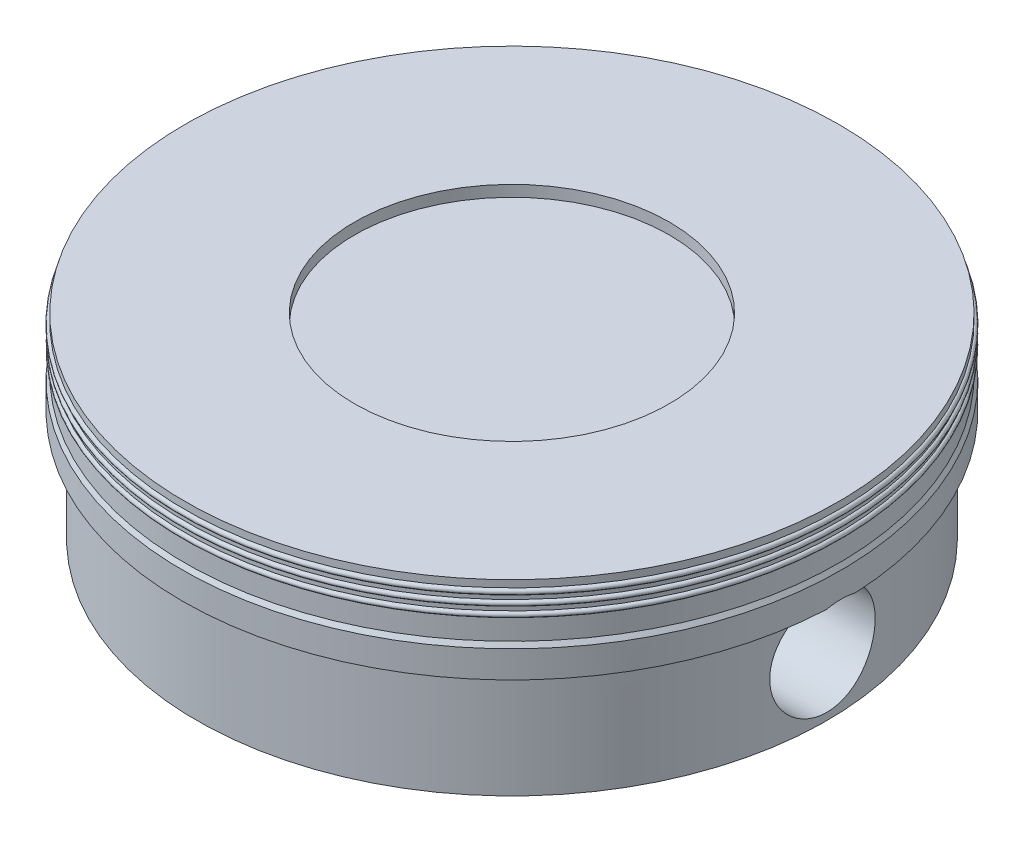
ISO-10303-21;
HEADER;
FILE_DESCRIPTION(('STEP AP214'),'2;1');
FILE_NAME('part.step','',(''),(''),'','','');
FILE_SCHEMA(('AUTOMOTIVE_DESIGN { 1 0 10303 214 1 1 1 1 }'));
ENDSEC;
DATA;
#1=APPLICATION_CONTEXT('core data for automotive mechanical design processes');
#2=APPLICATION_PROTOCOL_DEFINITION('international standard','automotive_design',2000,#1);
#3=PRODUCT_CONTEXT('',#1,'mechanical');
#4=PRODUCT('Part','Part','',(#3));
#5=PRODUCT_RELATED_PRODUCT_CATEGORY('part','',(#4));
#6=PRODUCT_DEFINITION_FORMATION('','',#4);
#7=PRODUCT_DEFINITION_CONTEXT('part definition',#1,'design');
#8=PRODUCT_DEFINITION('design','',#6,#7);
#9=PRODUCT_DEFINITION_SHAPE('','',#8);
#10=(LENGTH_UNIT() NAMED_UNIT(*) SI_UNIT(.MILLI.,.METRE.));
#11=(NAMED_UNIT(*) PLANE_ANGLE_UNIT() SI_UNIT($,.RADIAN.));
#12=(NAMED_UNIT(*) SI_UNIT($,.STERADIAN.) SOLID_ANGLE_UNIT());
#13=UNCERTAINTY_MEASURE_WITH_UNIT(LENGTH_MEASURE(1.E-05),#10,'distance_accuracy_value','');
#14=(GEOMETRIC_REPRESENTATION_CONTEXT(3) GLOBAL_UNCERTAINTY_ASSIGNED_CONTEXT((#13)) GLOBAL_UNIT_ASSIGNED_CONTEXT((#10,
#11,#12)) REPRESENTATION_CONTEXT('',''));
#15=CARTESIAN_POINT('',(0.,0.,0.));
#16=DIRECTION('',(0.,0.,1.));
#17=DIRECTION('',(1.,0.,0.));
#18=AXIS2_PLACEMENT_3D('',#15,#16,#17);
#19=CARTESIAN_POINT('',(5.,1.68,0.));
#20=DIRECTION('',(0.,-1.,0.));
#21=DIRECTION('',(0.,0.,-1.));
#22=AXIS2_PLACEMENT_3D('',#19,#20,#21);
#23=PLANE('',#22);
#24=DIRECTION('',(1.,0.,0.));
#25=VECTOR('',#24,1.);
#26=CARTESIAN_POINT('',(-5.00231465504995,1.68,-0.217025344142107));
#27=LINE('',#26,#25);
#28=CARTESIAN_POINT('',(-4.99528777949779,1.68,-0.217025344142107));
#29=VERTEX_POINT('',#28);
#30=CARTESIAN_POINT('',(-4.77507068010517,1.68,-0.217025344142107));
#31=VERTEX_POINT('',#30);
#32=EDGE_CURVE('E115',#29,#31,#27,.T.);
#33=ORIENTED_EDGE('',*,*,#32,.F.);
#34=CARTESIAN_POINT('',(0.,1.68,0.));
#35=DIRECTION('',(0.,-1.,0.));
#36=DIRECTION('',(0.,0.,-1.));
#37=AXIS2_PLACEMENT_3D('',#34,#35,#36);
#38=CIRCLE('',#37,5.);
#39=CARTESIAN_POINT('',(4.99528777949779,1.68,-0.217025344142107));
#40=VERTEX_POINT('',#39);
#41=EDGE_CURVE('E126',#29,#40,#38,.T.);
#42=ORIENTED_EDGE('',*,*,#41,.T.);
#43=CARTESIAN_POINT('',(4.77507068010517,1.68,-0.217025344142107));
#44=VERTEX_POINT('',#43);
#45=EDGE_CURVE('E60',#44,#40,#27,.T.);
#46=ORIENTED_EDGE('',*,*,#45,.F.);
#47=CARTESIAN_POINT('',(0.,1.68,0.));
#48=DIRECTION('',(0.,-1.,0.));
#49=DIRECTION('',(0.,0.,-1.));
#50=AXIS2_PLACEMENT_3D('',#47,#48,#49);
#51=CIRCLE('',#50,4.78);
#52=EDGE_CURVE('E45',#31,#44,#51,.T.);
#53=ORIENTED_EDGE('',*,*,#52,.F.);
#54=EDGE_LOOP('',(#33,#42,#46,#53));
#55=FACE_BOUND('',#54,.T.);
#56=ADVANCED_FACE('F35',(#55),#23,.T.);
#57=CARTESIAN_POINT('',(4.2,2.33,0.));
#58=DIRECTION('',(0.,-1.,0.));
#59=DIRECTION('',(0.,0.,-1.));
#60=AXIS2_PLACEMENT_3D('',#57,#58,#59);
#61=PLANE('',#60);
#62=CARTESIAN_POINT('',(0.,2.33,0.));
#63=DIRECTION('',(0.,-1.,0.));
#64=DIRECTION('',(0.,0.,-1.));
#65=AXIS2_PLACEMENT_3D('',#62,#63,#64);
#66=CIRCLE('',#65,4.2);
#67=CARTESIAN_POINT('',(0.,2.33,-4.2));
#68=VERTEX_POINT('',#67);
#69=EDGE_CURVE('E223',#68,#68,#66,.T.);
#70=ORIENTED_EDGE('',*,*,#69,.T.);
#71=EDGE_LOOP('',(#70));
#72=FACE_BOUND('',#71,.T.);
#73=DIRECTION('',(0.,0.,1.));
#74=VECTOR('',#73,1.);
#75=CARTESIAN_POINT('',(-1.5,2.33,3.08462315364454));
#76=LINE('',#75,#74);
#77=CARTESIAN_POINT('',(-1.5,2.33,-3.08462315364454));
#78=VERTEX_POINT('',#77);
#79=CARTESIAN_POINT('',(-1.5,2.33,3.08462315364454));
#80=VERTEX_POINT('',#79);
#81=EDGE_CURVE('E194',#78,#80,#76,.T.);
#82=ORIENTED_EDGE('',*,*,#81,.F.);
#83=CARTESIAN_POINT('',(0.,2.33,0.));
#84=DIRECTION('',(0.,-1.,0.));
#85=DIRECTION('',(0.,0.,-1.));
#86=AXIS2_PLACEMENT_3D('',#83,#84,#85);
#87=CIRCLE('',#86,3.43);
#88=EDGE_CURVE('E199',#80,#78,#87,.T.);
#89=ORIENTED_EDGE('',*,*,#88,.F.);
#90=EDGE_LOOP('',(#82,#89));
#91=FACE_BOUND('',#90,.T.);
#92=DIRECTION('',(0.,0.,-1.));
#93=VECTOR('',#92,1.);
#94=CARTESIAN_POINT('',(1.5,2.33,3.08462315364454));
#95=LINE('',#94,#93);
#96=CARTESIAN_POINT('',(1.5,2.33,3.08462315364454));
#97=VERTEX_POINT('',#96);
#98=CARTESIAN_POINT('',(1.5,2.33,-3.08462315364454));
#99=VERTEX_POINT('',#98);
#100=EDGE_CURVE('E176',#97,#99,#95,.T.);
#101=ORIENTED_EDGE('',*,*,#100,.F.);
#102=CARTESIAN_POINT('',(0.,2.33,0.));
#103=DIRECTION('',(0.,-1.,0.));
#104=DIRECTION('',(0.,0.,-1.));
#105=AXIS2_PLACEMENT_3D('',#102,#103,#104);
#106=CIRCLE('',#105,3.43);
#107=EDGE_CURVE('E181',#99,#97,#106,.T.);
#108=ORIENTED_EDGE('',*,*,#107,.F.);
#109=EDGE_LOOP('',(#101,#108));
#110=FACE_BOUND('',#109,.T.);
#111=ADVANCED_FACE('F272',(#72,#91,#110),#61,.T.);
#112=CARTESIAN_POINT('',(0.,0.,0.));
#113=DIRECTION('',(0.,-1.,0.));
#114=DIRECTION('',(0.,0.,-1.));
#115=AXIS2_PLACEMENT_3D('',#112,#113,#114);
#116=CYLINDRICAL_SURFACE('',#115,3.43);
#117=CARTESIAN_POINT('',(0.,1.93,0.));
#118=DIRECTION('',(0.,-1.,0.));
#119=DIRECTION('',(0.,0.,-1.));
#120=AXIS2_PLACEMENT_3D('',#117,#118,#119);
#121=CIRCLE('',#120,3.43);
#122=CARTESIAN_POINT('',(1.5,1.93,3.08462315364454));
#123=VERTEX_POINT('',#122);
#124=CARTESIAN_POINT('',(-1.5,1.93,3.08462315364454));
#125=VERTEX_POINT('',#124);
#126=EDGE_CURVE('E215',#123,#125,#121,.T.);
#127=ORIENTED_EDGE('',*,*,#126,.F.);
#128=DIRECTION('',(0.,1.,0.));
#129=VECTOR('',#128,1.);
#130=CARTESIAN_POINT('',(1.5,-6.46409313051723,3.08462315364454));
#131=LINE('',#130,#129);
#132=CARTESIAN_POINT('',(1.5,0.,3.08462315364454));
#133=VERTEX_POINT('',#132);
#134=EDGE_CURVE('E180',#133,#123,#131,.T.);
#135=ORIENTED_EDGE('',*,*,#134,.F.);
#136=CARTESIAN_POINT('',(0.,0.,0.));
#137=DIRECTION('',(0.,-1.,0.));
#138=DIRECTION('',(0.,0.,-1.));
#139=AXIS2_PLACEMENT_3D('',#136,#137,#138);
#140=CIRCLE('',#139,3.43);
#141=CARTESIAN_POINT('',(-1.5,0.,3.08462315364454));
#142=VERTEX_POINT('',#141);
#143=EDGE_CURVE('E212',#133,#142,#140,.T.);
#144=ORIENTED_EDGE('',*,*,#143,.T.);
#145=DIRECTION('',(0.,1.,0.));
#146=VECTOR('',#145,1.);
#147=CARTESIAN_POINT('',(-1.5,-6.46409313051723,3.08462315364454));
#148=LINE('',#147,#146);
#149=EDGE_CURVE('E202',#142,#125,#148,.T.);
#150=ORIENTED_EDGE('',*,*,#149,.T.);
#151=EDGE_LOOP('',(#127,#135,#144,#150));
#152=FACE_BOUND('',#151,.T.);
#153=ADVANCED_FACE('F277',(#152),#116,.F.);
#154=CARTESIAN_POINT('',(-1.5,0.,-3.08462315364454));
#155=VERTEX_POINT('',#154);
#156=CARTESIAN_POINT('',(1.5,0.,-3.08462315364454));
#157=VERTEX_POINT('',#156);
#158=EDGE_CURVE('E213',#155,#157,#140,.T.);
#159=ORIENTED_EDGE('',*,*,#158,.T.);
#160=DIRECTION('',(0.,1.,0.));
#161=VECTOR('',#160,1.);
#162=CARTESIAN_POINT('',(1.5,-6.46409313051723,-3.08462315364454));
#163=LINE('',#162,#161);
#164=CARTESIAN_POINT('',(1.5,1.93,-3.08462315364454));
#165=VERTEX_POINT('',#164);
#166=EDGE_CURVE('E184',#157,#165,#163,.T.);
#167=ORIENTED_EDGE('',*,*,#166,.T.);
#168=CARTESIAN_POINT('',(-1.5,1.93,-3.08462315364454));
#169=VERTEX_POINT('',#168);
#170=EDGE_CURVE('E220',#169,#165,#121,.T.);
#171=ORIENTED_EDGE('',*,*,#170,.F.);
#172=DIRECTION('',(0.,1.,0.));
#173=VECTOR('',#172,1.);
#174=CARTESIAN_POINT('',(-1.5,-6.46409313051723,-3.08462315364454));
#175=LINE('',#174,#173);
#176=EDGE_CURVE('E198',#155,#169,#175,.T.);
#177=ORIENTED_EDGE('',*,*,#176,.F.);
#178=EDGE_LOOP('',(#159,#167,#171,#177));
#179=FACE_BOUND('',#178,.T.);
#180=ADVANCED_FACE('F286',(#179),#116,.F.);
#181=CARTESIAN_POINT('',(0.,0.,0.));
#182=DIRECTION('',(0.,-1.,0.));
#183=DIRECTION('',(0.,0.,-1.));
#184=AXIS2_PLACEMENT_3D('',#181,#182,#183);
#185=CYLINDRICAL_SURFACE('',#184,4.78);
#186=CARTESIAN_POINT('',(-4.77507068010517,1.68,-0.217025344142108));
#187=CARTESIAN_POINT('',(-4.77311674454234,1.66781545501285,-0.260389997840914));
#188=CARTESIAN_POINT('',(-4.77058685151336,1.65191421075662,-0.302658617409448));
#189=CARTESIAN_POINT('',(-4.76473120839085,1.61331601743286,-0.383861318073952));
#190=CARTESIAN_POINT('',(-4.76140626252574,1.59062592976735,-0.422798715140795));
#191=CARTESIAN_POINT('',(-4.75431061348991,1.53905634512323,-0.496294501252224));
#192=CARTESIAN_POINT('',(-4.75053983511395,1.51017580323822,-0.530852149456165));
#193=CARTESIAN_POINT('',(-4.7429770373271,1.44704123469794,-0.594642145847164));
#194=CARTESIAN_POINT('',(-4.7391850190532,1.41278749307178,-0.623874776329791));
#195=CARTESIAN_POINT('',(-4.73198231554192,1.33963445348543,-0.676351887298078));
#196=CARTESIAN_POINT('',(-4.72857386348334,1.30071042802205,-0.699562233458879));
#197=CARTESIAN_POINT('',(-4.722554449733,1.21945126202537,-0.73910854464259));
#198=CARTESIAN_POINT('',(-4.7199435335669,1.17711592693891,-0.755444117253648));
#199=CARTESIAN_POINT('',(-4.71583989573606,1.09055475865284,-0.780651928805573));
#200=CARTESIAN_POINT('',(-4.71433931182688,1.04634460825845,-0.789576699682988));
#201=CARTESIAN_POINT('',(-4.71260225277348,0.957032751672788,-0.799880045235941));
#202=CARTESIAN_POINT('',(-4.71236561191707,0.911931163133861,-0.801259609143973));
#203=CARTESIAN_POINT('',(-4.71317900815314,0.822677727153014,-0.796460213173481));
#204=CARTESIAN_POINT('',(-4.71421397175652,0.778520946037443,-0.790369803192592));
#205=CARTESIAN_POINT('',(-4.7174257766452,0.691867355104174,-0.770966694821859));
#206=CARTESIAN_POINT('',(-4.71960265705315,0.649370602213479,-0.757653748983772));
#207=CARTESIAN_POINT('',(-4.72485660636636,0.56713060397223,-0.724165813365828));
#208=CARTESIAN_POINT('',(-4.72793556010964,0.527393341700135,-0.703976441127867));
#209=CARTESIAN_POINT('',(-4.73464750015667,0.451846186290576,-0.657317733090283));
#210=CARTESIAN_POINT('',(-4.7382805289058,0.416036594397233,-0.630847916085479));
#211=CARTESIAN_POINT('',(-4.74574814670546,0.348880399682881,-0.571982147608413));
#212=CARTESIAN_POINT('',(-4.74958470463595,0.317596008918016,-0.539515441920733));
#213=CARTESIAN_POINT('',(-4.75698830468753,0.26090071643192,-0.469776200289964));
#214=CARTESIAN_POINT('',(-4.76055533948057,0.23548997437027,-0.43250353375245));
#215=CARTESIAN_POINT('',(-4.76703400126186,0.1911835506644,-0.354034042364042));
#216=CARTESIAN_POINT('',(-4.76994321603747,0.172311716637691,-0.312823538628382));
#217=CARTESIAN_POINT('',(-4.77476061322142,0.141776205047494,-0.227758381569901));
#218=CARTESIAN_POINT('',(-4.77666887341471,0.13011196736357,-0.183903934005386));
#219=CARTESIAN_POINT('',(-4.77925311923535,0.114437264129416,-0.0953004936420972));
#220=CARTESIAN_POINT('',(-4.77994216086845,0.110345684668121,-0.0505662307842665));
#221=CARTESIAN_POINT('',(-4.78005079027309,0.10969643280476,0.0389570033491304));
#222=CARTESIAN_POINT('',(-4.7794704468681,0.113138351951783,0.0837459715270976));
#223=CARTESIAN_POINT('',(-4.77711565664269,0.127387693539074,0.171718625850184));
#224=CARTESIAN_POINT('',(-4.77535116971636,0.138133690579977,0.214912556661851));
#225=CARTESIAN_POINT('',(-4.77083222456877,0.16660481485125,0.298879816869771));
#226=CARTESIAN_POINT('',(-4.76807772295137,0.184330248020286,0.33965304006584));
#227=CARTESIAN_POINT('',(-4.76185735284646,0.226392438799284,0.417933619716713));
#228=CARTESIAN_POINT('',(-4.75838675692455,0.25077349929401,0.455416783633629));
#229=CARTESIAN_POINT('',(-4.75112593986705,0.305410165362693,0.525790773700132));
#230=CARTESIAN_POINT('',(-4.74733569379902,0.335666229422007,0.558681241091011));
#231=CARTESIAN_POINT('',(-4.73980727708292,0.401614121406434,0.619333370466703));
#232=CARTESIAN_POINT('',(-4.73607022605573,0.437365119679956,0.64703088003082));
#233=CARTESIAN_POINT('',(-4.72911708259974,0.513054069657323,0.696036212012279));
#234=CARTESIAN_POINT('',(-4.72590098778355,0.552992002172202,0.717344063712075));
#235=CARTESIAN_POINT('',(-4.72036394830086,0.635881027755402,0.752920794222775));
#236=CARTESIAN_POINT('',(-4.71804171930698,0.678827692065178,0.767199780566341));
#237=CARTESIAN_POINT('',(-4.71455803308112,0.766555057162941,0.788326469780904));
#238=CARTESIAN_POINT('',(-4.71339644749025,0.811335554571722,0.795174994415193));
#239=CARTESIAN_POINT('',(-4.71237792548226,0.900855119314812,0.801188832970666));
#240=CARTESIAN_POINT('',(-4.712504716309,0.945587583461906,0.800449977549886));
#241=CARTESIAN_POINT('',(-4.7140089366155,1.03428625093362,0.791542596891841));
#242=CARTESIAN_POINT('',(-4.71538641020499,1.07825242717667,0.783373809611892));
#243=CARTESIAN_POINT('',(-4.71922515448502,1.16399796218298,0.759903429890645));
#244=CARTESIAN_POINT('',(-4.72168213100792,1.2057852589046,0.744630084761228));
#245=CARTESIAN_POINT('',(-4.72740111237165,1.28620740457162,0.707411877504114));
#246=CARTESIAN_POINT('',(-4.73066306052802,1.32484247523554,0.685467485112687));
#247=CARTESIAN_POINT('',(-4.73766913754596,1.39832684053879,0.635246489063792));
#248=CARTESIAN_POINT('',(-4.74141811176241,1.43313053715318,0.606903797016646));
#249=CARTESIAN_POINT('',(-4.7489532451895,1.4975217381228,0.544812975714157));
#250=CARTESIAN_POINT('',(-4.75273941333657,1.5271079548491,0.511063516026313));
#251=CARTESIAN_POINT('',(-4.76019658054344,1.58221567707855,0.436382904178649));
#252=CARTESIAN_POINT('',(-4.76383860975078,1.60727795424229,0.395106051997313));
#253=CARTESIAN_POINT('',(-4.76862414691184,1.63903057077708,0.330299567261004));
#254=CARTESIAN_POINT('',(-4.77010793138987,1.6486502148414,0.308184135262336));
#255=CARTESIAN_POINT('',(-4.77280388719458,1.6658617378349,0.263159914490986));
#256=CARTESIAN_POINT('',(-4.77401603731461,1.67345345845173,0.240251063936713));
#257=CARTESIAN_POINT('',(-4.77507068010517,1.68,0.217025344142108));
#258=B_SPLINE_CURVE_WITH_KNOTS('',3,(#186,#187,#188,#189,#190,#191,#192,#193,#194,#195,#196,
#197,#198,#199,#200,#201,#202,#203,#204,#205,#206,#207,#208,#209,#210,#211,#212,#213,#214,#215,
#216,#217,#218,#219,#220,#221,#222,#223,#224,#225,#226,#227,#228,#229,#230,#231,#232,#233,#234,
#235,#236,#237,#238,#239,#240,#241,#242,#243,#244,#245,#246,#247,#248,#249,#250,#251,#252,#253,
#254,#255,#256,#257),.UNSPECIFIED.,.F.,.F.,(4,2,2,2,2,2,2,2,2,2,2,2,2,2,2,2,2,2,2,2,2,2,2,2,2,2,
2,2,2,2,2,2,2,2,2,4),(0.,0.135061280341502,0.269986514358779,0.404934540793564,
0.539875411135068,0.675565195916631,0.81126272481659,0.945989937250957,1.08069948552684,
1.21382749053972,1.34696005688289,1.48037280557488,1.61379577960147,1.74890717311241,
1.88402223883692,2.01962501133353,2.15521724447197,2.28934849434868,2.42347247208309,
2.556482234058,2.6894978270713,2.82342138218052,2.95735539288927,3.09284832298829,
3.22834063214234,3.36363752953,3.49891946238859,3.63249487099912,3.76607499079898,
3.89912848475602,4.03217261203068,4.16665952396069,4.30117957979026,4.4455970880261,
4.5179990352962,4.59040663306323),.UNSPECIFIED.);
#259=CARTESIAN_POINT('',(-4.77507068010517,1.68,0.217025344142107));
#260=VERTEX_POINT('',#259);
#261=EDGE_CURVE('E128',#31,#260,#258,.T.);
#262=ORIENTED_EDGE('',*,*,#261,.F.);
#263=ORIENTED_EDGE('',*,*,#52,.T.);
#264=CARTESIAN_POINT('',(4.77507068010517,1.68,0.217025344142108));
#265=CARTESIAN_POINT('',(4.77311674454234,1.66781545501285,0.260389997840914));
#266=CARTESIAN_POINT('',(4.77058685151336,1.65191421075662,0.302658617409448));
#267=CARTESIAN_POINT('',(4.76473120839085,1.61331601743286,0.383861318073952));
#268=CARTESIAN_POINT('',(4.76140626252574,1.59062592976735,0.422798715140795));
#269=CARTESIAN_POINT('',(4.75431061348991,1.53905634512323,0.496294501252224));
#270=CARTESIAN_POINT('',(4.75053983511395,1.51017580323822,0.530852149456165));
#271=CARTESIAN_POINT('',(4.7429770373271,1.44704123469794,0.594642145847164));
#272=CARTESIAN_POINT('',(4.7391850190532,1.41278749307178,0.623874776329791));
#273=CARTESIAN_POINT('',(4.73198231554192,1.33963445348543,0.676351887298078));
#274=CARTESIAN_POINT('',(4.72857386348334,1.30071042802205,0.699562233458879));
#275=CARTESIAN_POINT('',(4.722554449733,1.21945126202537,0.73910854464259));
#276=CARTESIAN_POINT('',(4.7199435335669,1.17711592693891,0.755444117253648));
#277=CARTESIAN_POINT('',(4.71583989573606,1.09055475865284,0.780651928805573));
#278=CARTESIAN_POINT('',(4.71433931182688,1.04634460825845,0.789576699682988));
#279=CARTESIAN_POINT('',(4.71260225277348,0.957032751672788,0.799880045235941));
#280=CARTESIAN_POINT('',(4.71236561191707,0.911931163133861,0.801259609143973));
#281=CARTESIAN_POINT('',(4.71317900815314,0.822677727153014,0.796460213173481));
#282=CARTESIAN_POINT('',(4.71421397175652,0.778520946037443,0.790369803192592));
#283=CARTESIAN_POINT('',(4.7174257766452,0.691867355104174,0.770966694821859));
#284=CARTESIAN_POINT('',(4.71960265705315,0.649370602213479,0.757653748983772));
#285=CARTESIAN_POINT('',(4.72485660636636,0.56713060397223,0.724165813365828));
#286=CARTESIAN_POINT('',(4.72793556010964,0.527393341700135,0.703976441127867));
#287=CARTESIAN_POINT('',(4.73464750015667,0.451846186290576,0.657317733090283));
#288=CARTESIAN_POINT('',(4.7382805289058,0.416036594397233,0.630847916085479));
#289=CARTESIAN_POINT('',(4.74574814670546,0.348880399682881,0.571982147608413));
#290=CARTESIAN_POINT('',(4.74958470463595,0.317596008918016,0.539515441920733));
#291=CARTESIAN_POINT('',(4.75698830468753,0.26090071643192,0.469776200289964));
#292=CARTESIAN_POINT('',(4.76055533948057,0.23548997437027,0.43250353375245));
#293=CARTESIAN_POINT('',(4.76703400126186,0.1911835506644,0.354034042364042));
#294=CARTESIAN_POINT('',(4.76994321603747,0.172311716637691,0.312823538628382));
#295=CARTESIAN_POINT('',(4.77476061322142,0.141776205047494,0.227758381569901));
#296=CARTESIAN_POINT('',(4.77666887341471,0.13011196736357,0.183903934005386));
#297=CARTESIAN_POINT('',(4.77925311923535,0.114437264129416,0.0953004936420972));
#298=CARTESIAN_POINT('',(4.77994216086845,0.110345684668121,0.0505662307842665));
#299=CARTESIAN_POINT('',(4.78005079027309,0.10969643280476,-0.0389570033491304));
#300=CARTESIAN_POINT('',(4.7794704468681,0.113138351951783,-0.0837459715270976));
#301=CARTESIAN_POINT('',(4.77711565664269,0.127387693539074,-0.171718625850184));
#302=CARTESIAN_POINT('',(4.77535116971636,0.138133690579977,-0.214912556661851));
#303=CARTESIAN_POINT('',(4.77083222456877,0.16660481485125,-0.298879816869771));
#304=CARTESIAN_POINT('',(4.76807772295137,0.184330248020286,-0.33965304006584));
#305=CARTESIAN_POINT('',(4.76185735284646,0.226392438799284,-0.417933619716713));
#306=CARTESIAN_POINT('',(4.75838675692455,0.25077349929401,-0.455416783633629));
#307=CARTESIAN_POINT('',(4.75112593986705,0.305410165362693,-0.525790773700132));
#308=CARTESIAN_POINT('',(4.74733569379902,0.335666229422007,-0.558681241091011));
#309=CARTESIAN_POINT('',(4.73980727708292,0.401614121406434,-0.619333370466703));
#310=CARTESIAN_POINT('',(4.73607022605573,0.437365119679956,-0.64703088003082));
#311=CARTESIAN_POINT('',(4.72911708259974,0.513054069657323,-0.696036212012279));
#312=CARTESIAN_POINT('',(4.72590098778355,0.552992002172202,-0.717344063712075));
#313=CARTESIAN_POINT('',(4.72036394830086,0.635881027755402,-0.752920794222775));
#314=CARTESIAN_POINT('',(4.71804171930698,0.678827692065178,-0.767199780566341));
#315=CARTESIAN_POINT('',(4.71455803308112,0.766555057162941,-0.788326469780904));
#316=CARTESIAN_POINT('',(4.71339644749025,0.811335554571722,-0.795174994415193));
#317=CARTESIAN_POINT('',(4.71237792548226,0.900855119314812,-0.801188832970666));
#318=CARTESIAN_POINT('',(4.712504716309,0.945587583461906,-0.800449977549886));
#319=CARTESIAN_POINT('',(4.7140089366155,1.03428625093362,-0.791542596891841));
#320=CARTESIAN_POINT('',(4.71538641020499,1.07825242717667,-0.783373809611892));
#321=CARTESIAN_POINT('',(4.71922515448502,1.16399796218298,-0.759903429890645));
#322=CARTESIAN_POINT('',(4.72168213100792,1.2057852589046,-0.744630084761228));
#323=CARTESIAN_POINT('',(4.72740111237165,1.28620740457162,-0.707411877504114));
#324=CARTESIAN_POINT('',(4.73066306052802,1.32484247523554,-0.685467485112687));
#325=CARTESIAN_POINT('',(4.73766913754596,1.39832684053879,-0.635246489063792));
#326=CARTESIAN_POINT('',(4.74141811176241,1.43313053715318,-0.606903797016646));
#327=CARTESIAN_POINT('',(4.7489532451895,1.4975217381228,-0.544812975714157));
#328=CARTESIAN_POINT('',(4.75273941333657,1.5271079548491,-0.511063516026313));
#329=CARTESIAN_POINT('',(4.76019658054344,1.58221567707855,-0.436382904178649));
#330=CARTESIAN_POINT('',(4.76383860975078,1.60727795424229,-0.395106051997313));
#331=CARTESIAN_POINT('',(4.76862414691184,1.63903057077708,-0.330299567261004));
#332=CARTESIAN_POINT('',(4.77010793138987,1.6486502148414,-0.308184135262336));
#333=CARTESIAN_POINT('',(4.77280388719458,1.6658617378349,-0.263159914490986));
#334=CARTESIAN_POINT('',(4.77401603731461,1.67345345845173,-0.240251063936713));
#335=CARTESIAN_POINT('',(4.77507068010517,1.68,-0.217025344142108));
#336=B_SPLINE_CURVE_WITH_KNOTS('',3,(#264,#265,#266,#267,#268,#269,#270,#271,#272,#273,#274,
#275,#276,#277,#278,#279,#280,#281,#282,#283,#284,#285,#286,#287,#288,#289,#290,#291,#292,#293,
#294,#295,#296,#297,#298,#299,#300,#301,#302,#303,#304,#305,#306,#307,#308,#309,#310,#311,#312,
#313,#314,#315,#316,#317,#318,#319,#320,#321,#322,#323,#324,#325,#326,#327,#328,#329,#330,#331,
#332,#333,#334,#335),.UNSPECIFIED.,.F.,.F.,(4,2,2,2,2,2,2,2,2,2,2,2,2,2,2,2,2,2,2,2,2,2,2,2,2,2,
2,2,2,2,2,2,2,2,2,4),(0.,0.135061280341502,0.269986514358779,0.404934540793564,
0.539875411135068,0.675565195916631,0.81126272481659,0.945989937250957,1.08069948552684,
1.21382749053972,1.34696005688289,1.48037280557488,1.61379577960147,1.74890717311241,
1.88402223883692,2.01962501133353,2.15521724447197,2.28934849434868,2.42347247208309,
2.556482234058,2.6894978270713,2.82342138218052,2.95735539288927,3.09284832298829,
3.22834063214234,3.36363752953,3.49891946238859,3.63249487099912,3.76607499079898,
3.89912848475602,4.03217261203068,4.16665952396069,4.30117957979026,4.4455970880261,
4.5179990352962,4.59040663306323),.UNSPECIFIED.);
#337=CARTESIAN_POINT('',(4.77507068010517,1.68,0.217025344142107));
#338=VERTEX_POINT('',#337);
#339=EDGE_CURVE('E143',#338,#44,#336,.T.);
#340=ORIENTED_EDGE('',*,*,#339,.F.);
#341=EDGE_CURVE('E11',#338,#260,#51,.T.);
#342=ORIENTED_EDGE('',*,*,#341,.T.);
#343=EDGE_LOOP('',(#262,#263,#340,#342));
#344=FACE_BOUND('',#343,.T.);
#345=CARTESIAN_POINT('',(0.,0.,0.));
#346=DIRECTION('',(0.,-1.,0.));
#347=DIRECTION('',(0.,0.,-1.));
#348=AXIS2_PLACEMENT_3D('',#345,#346,#347);
#349=CIRCLE('',#348,4.78);
#350=CARTESIAN_POINT('',(0.,0.,-4.78));
#351=VERTEX_POINT('',#350);
#352=EDGE_CURVE('E205',#351,#351,#349,.T.);
#353=ORIENTED_EDGE('',*,*,#352,.F.);
#354=EDGE_LOOP('',(#353));
#355=FACE_BOUND('',#354,.T.);
#356=ADVANCED_FACE('F37',(#344,#355),#185,.T.);
#357=DIRECTION('',(1.,0.,0.));
#358=VECTOR('',#357,1.);
#359=CARTESIAN_POINT('',(-5.00231465504995,1.68,0.217025344142107));
#360=LINE('',#359,#358);
#361=CARTESIAN_POINT('',(4.99528777949779,1.68,0.217025344142107));
#362=VERTEX_POINT('',#361);
#363=EDGE_CURVE('E146',#362,#338,#360,.F.);
#364=ORIENTED_EDGE('',*,*,#363,.F.);
#365=CARTESIAN_POINT('',(-4.99528777949779,1.68,0.217025344142107));
#366=VERTEX_POINT('',#365);
#367=EDGE_CURVE('E133',#362,#366,#38,.T.);
#368=ORIENTED_EDGE('',*,*,#367,.T.);
#369=EDGE_CURVE('E52',#260,#366,#360,.F.);
#370=ORIENTED_EDGE('',*,*,#369,.F.);
#371=ORIENTED_EDGE('',*,*,#341,.F.);
#372=EDGE_LOOP('',(#364,#368,#370,#371));
#373=FACE_BOUND('',#372,.T.);
#374=ADVANCED_FACE('F273',(#373),#23,.T.);
#375=CARTESIAN_POINT('',(0.,0.,0.));
#376=DIRECTION('',(0.,-1.,0.));
#377=DIRECTION('',(0.,0.,-1.));
#378=AXIS2_PLACEMENT_3D('',#375,#376,#377);
#379=CYLINDRICAL_SURFACE('',#378,5.);
#380=CARTESIAN_POINT('',(4.99528777949779,1.68,-0.217025344142107));
#381=CARTESIAN_POINT('',(4.9962289677488,1.68610106058928,-0.195376542677368));
#382=CARTESIAN_POINT('',(4.99703852701703,1.69128766111012,-0.173477485348043));
#383=CARTESIAN_POINT('',(4.99837648438901,1.69980153137872,-0.129307503830496));
#384=CARTESIAN_POINT('',(4.9989048203015,1.70312838986114,-0.107036498509832));
#385=CARTESIAN_POINT('',(5.00002251450322,1.71015664531778,-0.0409416851132631));
#386=CARTESIAN_POINT('',(5.00019087516558,1.71119783067905,0.00321039652630672));
#387=CARTESIAN_POINT('',(4.99950986075141,1.70693153463769,0.0756308582289189));
#388=CARTESIAN_POINT('',(4.99899604063542,1.70371836424206,0.104050377357216));
#389=CARTESIAN_POINT('',(4.99749606245128,1.694208819851,0.160800504746172));
#390=CARTESIAN_POINT('',(4.99650285198295,1.6878663785966,0.189123213080513));
#391=CARTESIAN_POINT('',(4.99528777949779,1.68,0.217025344142107));
#392=B_SPLINE_CURVE_WITH_KNOTS('',3,(#380,#381,#382,#383,#384,#385,#386,#387,#388,#389,#390,
#391),.UNSPECIFIED.,.F.,.F.,(4,2,2,2,2,4),(0.,0.0674894445675057,0.134993807924421,
0.266780752005559,0.352446419941875,0.439412626048507),.UNSPECIFIED.);
#393=EDGE_CURVE('E132',#40,#362,#392,.T.);
#394=ORIENTED_EDGE('',*,*,#393,.F.);
#395=ORIENTED_EDGE('',*,*,#41,.F.);
#396=CARTESIAN_POINT('',(-4.99528777949779,1.68,0.217025344142107));
#397=CARTESIAN_POINT('',(-4.9962289677488,1.68610106058928,0.195376542677368));
#398=CARTESIAN_POINT('',(-4.99703852701703,1.69128766111012,0.173477485348043));
#399=CARTESIAN_POINT('',(-4.99837648438901,1.69980153137872,0.129307503830496));
#400=CARTESIAN_POINT('',(-4.9989048203015,1.70312838986114,0.107036498509832));
#401=CARTESIAN_POINT('',(-5.00002251450322,1.71015664531778,0.0409416851132631));
#402=CARTESIAN_POINT('',(-5.00019087516558,1.71119783067905,-0.00321039652630672));
#403=CARTESIAN_POINT('',(-4.99950986075141,1.70693153463769,-0.0756308582289189));
#404=CARTESIAN_POINT('',(-4.99899604063542,1.70371836424206,-0.104050377357216));
#405=CARTESIAN_POINT('',(-4.99749606245128,1.694208819851,-0.160800504746172));
#406=CARTESIAN_POINT('',(-4.99650285198295,1.6878663785966,-0.189123213080513));
#407=CARTESIAN_POINT('',(-4.99528777949779,1.68,-0.217025344142107));
#408=B_SPLINE_CURVE_WITH_KNOTS('',3,(#396,#397,#398,#399,#400,#401,#402,#403,#404,#405,#406,
#407),.UNSPECIFIED.,.F.,.F.,(4,2,2,2,2,4),(0.,0.0674894445675057,0.134993807924421,
0.266780752005559,0.352446419941875,0.439412626048507),.UNSPECIFIED.);
#409=EDGE_CURVE('E111',#366,#29,#408,.T.);
#410=ORIENTED_EDGE('',*,*,#409,.F.);
#411=ORIENTED_EDGE('',*,*,#367,.F.);
#412=EDGE_LOOP('',(#394,#395,#410,#411));
#413=FACE_BOUND('',#412,.T.);
#414=CARTESIAN_POINT('',(0.,2.09,0.));
#415=DIRECTION('',(0.,-1.,0.));
#416=DIRECTION('',(0.,0.,-1.));
#417=AXIS2_PLACEMENT_3D('',#414,#415,#416);
#418=CIRCLE('',#417,5.);
#419=CARTESIAN_POINT('',(0.,2.09,-5.));
#420=VERTEX_POINT('',#419);
#421=EDGE_CURVE('E134',#420,#420,#418,.T.);
#422=ORIENTED_EDGE('',*,*,#421,.T.);
#423=EDGE_LOOP('',(#422));
#424=FACE_BOUND('',#423,.T.);
#425=ADVANCED_FACE('F130',(#413,#424),#379,.T.);
#426=CARTESIAN_POINT('',(0.,2.09,0.));
#427=DIRECTION('',(0.,-1.,0.));
#428=DIRECTION('',(0.,0.,-1.));
#429=AXIS2_PLACEMENT_3D('',#426,#427,#428);
#430=CONICAL_SURFACE('',#429,5.,0.519146114246523);
#431=CARTESIAN_POINT('',(0.,2.16,0.));
#432=DIRECTION('',(0.,-1.,0.));
#433=DIRECTION('',(0.,0.,-1.));
#434=AXIS2_PLACEMENT_3D('',#431,#432,#433);
#435=CIRCLE('',#434,4.96);
#436=CARTESIAN_POINT('',(0.,2.16,-4.96));
#437=VERTEX_POINT('',#436);
#438=EDGE_CURVE('E137',#437,#437,#435,.T.);
#439=ORIENTED_EDGE('',*,*,#438,.T.);
#440=EDGE_LOOP('',(#439));
#441=FACE_BOUND('',#440,.T.);
#442=ORIENTED_EDGE('',*,*,#421,.F.);
#443=EDGE_LOOP('',(#442));
#444=FACE_BOUND('',#443,.T.);
#445=ADVANCED_FACE('F255',(#441,#444),#430,.T.);
#446=CARTESIAN_POINT('',(0.,0.,0.));
#447=DIRECTION('',(0.,-1.,0.));
#448=DIRECTION('',(0.,0.,-1.));
#449=AXIS2_PLACEMENT_3D('',#446,#447,#448);
#450=CYLINDRICAL_SURFACE('',#449,4.96);
#451=CARTESIAN_POINT('',(0.,2.48,0.));
#452=DIRECTION('',(0.,-1.,0.));
#453=DIRECTION('',(0.,0.,-1.));
#454=AXIS2_PLACEMENT_3D('',#451,#452,#453);
#455=CIRCLE('',#454,4.96);
#456=CARTESIAN_POINT('',(0.,2.48,-4.96));
#457=VERTEX_POINT('',#456);
#458=EDGE_CURVE('E250',#457,#457,#455,.T.);
#459=ORIENTED_EDGE('',*,*,#458,.T.);
#460=EDGE_LOOP('',(#459));
#461=FACE_BOUND('',#460,.T.);
#462=ORIENTED_EDGE('',*,*,#438,.F.);
#463=EDGE_LOOP('',(#462));
#464=FACE_BOUND('',#463,.T.);
#465=ADVANCED_FACE('F258',(#461,#464),#450,.T.);
#466=CARTESIAN_POINT('',(0.,2.52,0.));
#467=DIRECTION('',(0.,-1.,0.));
#468=DIRECTION('',(0.,0.,-1.));
#469=AXIS2_PLACEMENT_3D('',#466,#467,#468);
#470=TOROIDAL_SURFACE('',#469,4.96,0.0400000000000005);
#471=CARTESIAN_POINT('',(0.,2.56,0.));
#472=DIRECTION('',(0.,-1.,0.));
#473=DIRECTION('',(0.,0.,-1.));
#474=AXIS2_PLACEMENT_3D('',#471,#472,#473);
#475=CIRCLE('',#474,4.96);
#476=CARTESIAN_POINT('',(0.,2.56,-4.96));
#477=VERTEX_POINT('',#476);
#478=EDGE_CURVE('E247',#477,#477,#475,.T.);
#479=ORIENTED_EDGE('',*,*,#478,.T.);
#480=EDGE_LOOP('',(#479));
#481=FACE_BOUND('',#480,.T.);
#482=ORIENTED_EDGE('',*,*,#458,.F.);
#483=EDGE_LOOP('',(#482));
#484=FACE_BOUND('',#483,.T.);
#485=ADVANCED_FACE('F260',(#481,#484),#470,.T.);
#486=CARTESIAN_POINT('',(0.,0.,0.));
#487=DIRECTION('',(0.,-1.,0.));
#488=DIRECTION('',(0.,0.,-1.));
#489=AXIS2_PLACEMENT_3D('',#486,#487,#488);
#490=CYLINDRICAL_SURFACE('',#489,4.96);
#491=CARTESIAN_POINT('',(0.,2.63,0.));
#492=DIRECTION('',(0.,-1.,0.));
#493=DIRECTION('',(0.,0.,-1.));
#494=AXIS2_PLACEMENT_3D('',#491,#492,#493);
#495=CIRCLE('',#494,4.96);
#496=CARTESIAN_POINT('',(0.,2.63,-4.96));
#497=VERTEX_POINT('',#496);
#498=EDGE_CURVE('E244',#497,#497,#495,.T.);
#499=ORIENTED_EDGE('',*,*,#498,.T.);
#500=EDGE_LOOP('',(#499));
#501=FACE_BOUND('',#500,.T.);
#502=ORIENTED_EDGE('',*,*,#478,.F.);
#503=EDGE_LOOP('',(#502));
#504=FACE_BOUND('',#503,.T.);
#505=ADVANCED_FACE('F267',(#501,#504),#490,.T.);
#506=CARTESIAN_POINT('',(0.,2.67,0.));
#507=DIRECTION('',(0.,-1.,0.));
#508=DIRECTION('',(0.,0.,-1.));
#509=AXIS2_PLACEMENT_3D('',#506,#507,#508);
#510=TOROIDAL_SURFACE('',#509,4.96,0.0400000000000005);
#511=CARTESIAN_POINT('',(0.,2.71,0.));
#512=DIRECTION('',(0.,-1.,0.));
#513=DIRECTION('',(0.,0.,-1.));
#514=AXIS2_PLACEMENT_3D('',#511,#512,#513);
#515=CIRCLE('',#514,4.96);
#516=CARTESIAN_POINT('',(0.,2.71,-4.96));
#517=VERTEX_POINT('',#516);
#518=EDGE_CURVE('E241',#517,#517,#515,.T.);
#519=ORIENTED_EDGE('',*,*,#518,.T.);
#520=EDGE_LOOP('',(#519));
#521=FACE_BOUND('',#520,.T.);
#522=ORIENTED_EDGE('',*,*,#498,.F.);
#523=EDGE_LOOP('',(#522));
#524=FACE_BOUND('',#523,.T.);
#525=ADVANCED_FACE('F374',(#521,#524),#510,.T.);
#526=CARTESIAN_POINT('',(0.,0.,0.));
#527=DIRECTION('',(0.,-1.,0.));
#528=DIRECTION('',(0.,0.,-1.));
#529=AXIS2_PLACEMENT_3D('',#526,#527,#528);
#530=CYLINDRICAL_SURFACE('',#529,4.96);
#531=CARTESIAN_POINT('',(0.,2.77768534495005,0.));
#532=DIRECTION('',(0.,-1.,0.));
#533=DIRECTION('',(0.,0.,-1.));
#534=AXIS2_PLACEMENT_3D('',#531,#532,#533);
#535=CIRCLE('',#534,4.96);
#536=CARTESIAN_POINT('',(0.,2.77768534495005,-4.96));
#537=VERTEX_POINT('',#536);
#538=EDGE_CURVE('E238',#537,#537,#535,.T.);
#539=ORIENTED_EDGE('',*,*,#538,.T.);
#540=EDGE_LOOP('',(#539));
#541=FACE_BOUND('',#540,.T.);
#542=ORIENTED_EDGE('',*,*,#518,.F.);
#543=EDGE_LOOP('',(#542));
#544=FACE_BOUND('',#543,.T.);
#545=ADVANCED_FACE('F370',(#541,#544),#530,.T.);
#546=CARTESIAN_POINT('',(0.,2.82,0.));
#547=DIRECTION('',(0.,-1.,0.));
#548=DIRECTION('',(0.,0.,-1.));
#549=AXIS2_PLACEMENT_3D('',#546,#547,#548);
#550=TOROIDAL_SURFACE('',#549,4.96,0.0423146550499491);
#551=CARTESIAN_POINT('',(0.,2.86231465504995,0.));
#552=DIRECTION('',(0.,-1.,0.));
#553=DIRECTION('',(0.,0.,-1.));
#554=AXIS2_PLACEMENT_3D('',#551,#552,#553);
#555=CIRCLE('',#554,4.96);
#556=CARTESIAN_POINT('',(0.,2.86231465504995,-4.96));
#557=VERTEX_POINT('',#556);
#558=EDGE_CURVE('E235',#557,#557,#555,.T.);
#559=ORIENTED_EDGE('',*,*,#558,.T.);
#560=EDGE_LOOP('',(#559));
#561=FACE_BOUND('',#560,.T.);
#562=ORIENTED_EDGE('',*,*,#538,.F.);
#563=EDGE_LOOP('',(#562));
#564=FACE_BOUND('',#563,.T.);
#565=ADVANCED_FACE('F366',(#561,#564),#550,.T.);
#566=CARTESIAN_POINT('',(0.,0.,0.));
#567=DIRECTION('',(0.,-1.,0.));
#568=DIRECTION('',(0.,0.,-1.));
#569=AXIS2_PLACEMENT_3D('',#566,#567,#568);
#570=CYLINDRICAL_SURFACE('',#569,4.96);
#571=CARTESIAN_POINT('',(0.,2.97,0.));
#572=DIRECTION('',(0.,-1.,0.));
#573=DIRECTION('',(0.,0.,-1.));
#574=AXIS2_PLACEMENT_3D('',#571,#572,#573);
#575=CIRCLE('',#574,4.96);
#576=CARTESIAN_POINT('',(0.,2.97,-4.96));
#577=VERTEX_POINT('',#576);
#578=EDGE_CURVE('E232',#577,#577,#575,.T.);
#579=ORIENTED_EDGE('',*,*,#578,.T.);
#580=EDGE_LOOP('',(#579));
#581=FACE_BOUND('',#580,.T.);
#582=ORIENTED_EDGE('',*,*,#558,.F.);
#583=EDGE_LOOP('',(#582));
#584=FACE_BOUND('',#583,.T.);
#585=ADVANCED_FACE('F362',(#581,#584),#570,.T.);
#586=CARTESIAN_POINT('',(2.39,2.97,0.));
#587=DIRECTION('',(0.,1.,0.));
#588=DIRECTION('',(0.,0.,1.));
#589=AXIS2_PLACEMENT_3D('',#586,#587,#588);
#590=PLANE('',#589);
#591=CARTESIAN_POINT('',(0.,2.97,0.));
#592=DIRECTION('',(0.,-1.,0.));
#593=DIRECTION('',(0.,0.,-1.));
#594=AXIS2_PLACEMENT_3D('',#591,#592,#593);
#595=CIRCLE('',#594,2.39);
#596=CARTESIAN_POINT('',(0.,2.97,-2.39));
#597=VERTEX_POINT('',#596);
#598=EDGE_CURVE('E229',#597,#597,#595,.T.);
#599=ORIENTED_EDGE('',*,*,#598,.T.);
#600=EDGE_LOOP('',(#599));
#601=FACE_BOUND('',#600,.T.);
#602=ORIENTED_EDGE('',*,*,#578,.F.);
#603=EDGE_LOOP('',(#602));
#604=FACE_BOUND('',#603,.T.);
#605=ADVANCED_FACE('F358',(#601,#604),#590,.T.);
#606=CARTESIAN_POINT('',(0.,0.,0.));
#607=DIRECTION('',(0.,-1.,0.));
#608=DIRECTION('',(0.,0.,-1.));
#609=AXIS2_PLACEMENT_3D('',#606,#607,#608);
#610=CYLINDRICAL_SURFACE('',#609,2.39);
#611=CARTESIAN_POINT('',(0.,2.8,0.));
#612=DIRECTION('',(0.,-1.,0.));
#613=DIRECTION('',(0.,0.,-1.));
#614=AXIS2_PLACEMENT_3D('',#611,#612,#613);
#615=CIRCLE('',#614,2.39);
#616=CARTESIAN_POINT('',(0.,2.8,-2.39));
#617=VERTEX_POINT('',#616);
#618=EDGE_CURVE('E226',#617,#617,#615,.T.);
#619=ORIENTED_EDGE('',*,*,#618,.T.);
#620=EDGE_LOOP('',(#619));
#621=FACE_BOUND('',#620,.T.);
#622=ORIENTED_EDGE('',*,*,#598,.F.);
#623=EDGE_LOOP('',(#622));
#624=FACE_BOUND('',#623,.T.);
#625=ADVANCED_FACE('F354',(#621,#624),#610,.F.);
#626=CARTESIAN_POINT('',(0.,2.8,0.));
#627=DIRECTION('',(0.,1.,0.));
#628=DIRECTION('',(0.,0.,1.));
#629=AXIS2_PLACEMENT_3D('',#626,#627,#628);
#630=PLANE('',#629);
#631=ORIENTED_EDGE('',*,*,#618,.F.);
#632=EDGE_LOOP('',(#631));
#633=FACE_BOUND('',#632,.T.);
#634=ADVANCED_FACE('F349',(#633),#630,.T.);
#635=CARTESIAN_POINT('',(0.,0.,0.));
#636=DIRECTION('',(0.,-1.,0.));
#637=DIRECTION('',(0.,0.,-1.));
#638=AXIS2_PLACEMENT_3D('',#635,#636,#637);
#639=CYLINDRICAL_SURFACE('',#638,4.2);
#640=CARTESIAN_POINT('',(0.,1.93,0.));
#641=DIRECTION('',(0.,-1.,0.));
#642=DIRECTION('',(0.,0.,-1.));
#643=AXIS2_PLACEMENT_3D('',#640,#641,#642);
#644=CIRCLE('',#643,4.2);
#645=CARTESIAN_POINT('',(0.,1.93,-4.2));
#646=VERTEX_POINT('',#645);
#647=EDGE_CURVE('E219',#646,#646,#644,.T.);
#648=ORIENTED_EDGE('',*,*,#647,.T.);
#649=EDGE_LOOP('',(#648));
#650=FACE_BOUND('',#649,.T.);
#651=ORIENTED_EDGE('',*,*,#69,.F.);
#652=EDGE_LOOP('',(#651));
#653=FACE_BOUND('',#652,.T.);
#654=ADVANCED_FACE('F347',(#650,#653),#639,.F.);
#655=CARTESIAN_POINT('',(3.43,1.93,0.));
#656=DIRECTION('',(0.,1.,0.));
#657=DIRECTION('',(0.,0.,1.));
#658=AXIS2_PLACEMENT_3D('',#655,#656,#657);
#659=PLANE('',#658);
#660=EDGE_CURVE('E216',#125,#169,#121,.T.);
#661=ORIENTED_EDGE('',*,*,#660,.T.);
#662=ORIENTED_EDGE('',*,*,#170,.T.);
#663=CARTESIAN_POINT('',(0.,1.93,0.));
#664=DIRECTION('',(0.,1.,0.));
#665=DIRECTION('',(0.,0.,1.));
#666=AXIS2_PLACEMENT_3D('',#663,#664,#665);
#667=CIRCLE('',#666,3.43);
#668=EDGE_CURVE('E187',#165,#123,#667,.F.);
#669=ORIENTED_EDGE('',*,*,#668,.T.);
#670=ORIENTED_EDGE('',*,*,#126,.T.);
#671=EDGE_LOOP('',(#661,#662,#669,#670));
#672=FACE_BOUND('',#671,.T.);
#673=ORIENTED_EDGE('',*,*,#647,.F.);
#674=EDGE_LOOP('',(#673));
#675=FACE_BOUND('',#674,.T.);
#676=ADVANCED_FACE('F318',(#672,#675),#659,.T.);
#677=CARTESIAN_POINT('',(4.78,0.,0.));
#678=DIRECTION('',(0.,-1.,0.));
#679=DIRECTION('',(0.,0.,-1.));
#680=AXIS2_PLACEMENT_3D('',#677,#678,#679);
#681=PLANE('',#680);
#682=ORIENTED_EDGE('',*,*,#352,.T.);
#683=EDGE_LOOP('',(#682));
#684=FACE_BOUND('',#683,.T.);
#685=ORIENTED_EDGE('',*,*,#158,.F.);
#686=DIRECTION('',(0.,0.,1.));
#687=VECTOR('',#686,1.);
#688=CARTESIAN_POINT('',(-1.5,0.,3.08462315364454));
#689=LINE('',#688,#687);
#690=EDGE_CURVE('E197',#155,#142,#689,.T.);
#691=ORIENTED_EDGE('',*,*,#690,.T.);
#692=ORIENTED_EDGE('',*,*,#143,.F.);
#693=DIRECTION('',(0.,0.,-1.));
#694=VECTOR('',#693,1.);
#695=CARTESIAN_POINT('',(1.5,0.,3.08462315364454));
#696=LINE('',#695,#694);
#697=EDGE_CURVE('E179',#133,#157,#696,.T.);
#698=ORIENTED_EDGE('',*,*,#697,.T.);
#699=EDGE_LOOP('',(#685,#691,#692,#698));
#700=FACE_BOUND('',#699,.T.);
#701=ADVANCED_FACE('F308',(#684,#700),#681,.T.);
#702=CARTESIAN_POINT('',(0.,-6.46409313051723,0.));
#703=DIRECTION('',(0.,1.,0.));
#704=DIRECTION('',(0.,0.,1.));
#705=AXIS2_PLACEMENT_3D('',#702,#703,#704);
#706=CYLINDRICAL_SURFACE('',#705,3.43);
#707=ORIENTED_EDGE('',*,*,#660,.F.);
#708=EDGE_CURVE('E193',#125,#80,#148,.T.);
#709=ORIENTED_EDGE('',*,*,#708,.T.);
#710=ORIENTED_EDGE('',*,*,#88,.T.);
#711=EDGE_CURVE('E201',#169,#78,#175,.T.);
#712=ORIENTED_EDGE('',*,*,#711,.F.);
#713=EDGE_LOOP('',(#707,#709,#710,#712));
#714=FACE_BOUND('',#713,.T.);
#715=ADVANCED_FACE('F300',(#714),#706,.T.);
#716=CARTESIAN_POINT('',(-1.5,-6.46409313051723,3.08462315364454));
#717=DIRECTION('',(-1.,0.,0.));
#718=DIRECTION('',(0.,0.,1.));
#719=AXIS2_PLACEMENT_3D('',#716,#717,#718);
#720=PLANE('',#719);
#721=CARTESIAN_POINT('',(-1.5,0.91,0.));
#722=DIRECTION('',(-1.,0.,0.));
#723=DIRECTION('',(0.,0.,1.));
#724=AXIS2_PLACEMENT_3D('',#721,#722,#723);
#725=CIRCLE('',#724,0.8);
#726=CARTESIAN_POINT('',(-1.5,0.91,0.8));
#727=VERTEX_POINT('',#726);
#728=EDGE_CURVE('E121',#727,#727,#725,.T.);
#729=ORIENTED_EDGE('',*,*,#728,.T.);
#730=EDGE_LOOP('',(#729));
#731=FACE_BOUND('',#730,.T.);
#732=ORIENTED_EDGE('',*,*,#690,.F.);
#733=ORIENTED_EDGE('',*,*,#176,.T.);
#734=ORIENTED_EDGE('',*,*,#711,.T.);
#735=ORIENTED_EDGE('',*,*,#81,.T.);
#736=ORIENTED_EDGE('',*,*,#708,.F.);
#737=ORIENTED_EDGE('',*,*,#149,.F.);
#738=EDGE_LOOP('',(#732,#733,#734,#735,#736,#737));
#739=FACE_BOUND('',#738,.T.);
#740=ADVANCED_FACE('F296',(#731,#739),#720,.F.);
#741=CARTESIAN_POINT('',(0.,-6.46409313051723,0.));
#742=DIRECTION('',(0.,1.,0.));
#743=DIRECTION('',(0.,0.,1.));
#744=AXIS2_PLACEMENT_3D('',#741,#742,#743);
#745=CYLINDRICAL_SURFACE('',#744,3.43);
#746=ORIENTED_EDGE('',*,*,#668,.F.);
#747=EDGE_CURVE('E175',#165,#99,#163,.T.);
#748=ORIENTED_EDGE('',*,*,#747,.T.);
#749=ORIENTED_EDGE('',*,*,#107,.T.);
#750=EDGE_CURVE('E183',#123,#97,#131,.T.);
#751=ORIENTED_EDGE('',*,*,#750,.F.);
#752=EDGE_LOOP('',(#746,#748,#749,#751));
#753=FACE_BOUND('',#752,.T.);
#754=ADVANCED_FACE('F299',(#753),#745,.T.);
#755=CARTESIAN_POINT('',(1.5,-6.46409313051723,3.08462315364454));
#756=DIRECTION('',(1.,0.,0.));
#757=DIRECTION('',(0.,0.,-1.));
#758=AXIS2_PLACEMENT_3D('',#755,#756,#757);
#759=PLANE('',#758);
#760=CARTESIAN_POINT('',(1.5,0.91,0.));
#761=DIRECTION('',(1.,0.,0.));
#762=DIRECTION('',(0.,0.,-1.));
#763=AXIS2_PLACEMENT_3D('',#760,#761,#762);
#764=CIRCLE('',#763,0.8);
#765=CARTESIAN_POINT('',(1.5,0.91,-0.8));
#766=VERTEX_POINT('',#765);
#767=EDGE_CURVE('E40',#766,#766,#764,.T.);
#768=ORIENTED_EDGE('',*,*,#767,.T.);
#769=EDGE_LOOP('',(#768));
#770=FACE_BOUND('',#769,.T.);
#771=ORIENTED_EDGE('',*,*,#697,.F.);
#772=ORIENTED_EDGE('',*,*,#134,.T.);
#773=ORIENTED_EDGE('',*,*,#750,.T.);
#774=ORIENTED_EDGE('',*,*,#100,.T.);
#775=ORIENTED_EDGE('',*,*,#747,.F.);
#776=ORIENTED_EDGE('',*,*,#166,.F.);
#777=EDGE_LOOP('',(#771,#772,#773,#774,#775,#776));
#778=FACE_BOUND('',#777,.T.);
#779=ADVANCED_FACE('F162',(#770,#778),#759,.F.);
#780=CARTESIAN_POINT('',(-5.00231465504995,0.91,0.));
#781=DIRECTION('',(1.,0.,0.));
#782=DIRECTION('',(0.,0.,-1.));
#783=AXIS2_PLACEMENT_3D('',#780,#781,#782);
#784=CYLINDRICAL_SURFACE('',#783,0.8);
#785=ORIENTED_EDGE('',*,*,#339,.T.);
#786=ORIENTED_EDGE('',*,*,#45,.T.);
#787=ORIENTED_EDGE('',*,*,#393,.T.);
#788=ORIENTED_EDGE('',*,*,#363,.T.);
#789=EDGE_LOOP('',(#785,#786,#787,#788));
#790=FACE_BOUND('',#789,.T.);
#791=ORIENTED_EDGE('',*,*,#767,.F.);
#792=EDGE_LOOP('',(#791));
#793=FACE_BOUND('',#792,.T.);
#794=ADVANCED_FACE('F161',(#790,#793),#784,.F.);
#795=ORIENTED_EDGE('',*,*,#261,.T.);
#796=ORIENTED_EDGE('',*,*,#369,.T.);
#797=ORIENTED_EDGE('',*,*,#409,.T.);
#798=ORIENTED_EDGE('',*,*,#32,.T.);
#799=EDGE_LOOP('',(#795,#796,#797,#798));
#800=FACE_BOUND('',#799,.T.);
#801=ORIENTED_EDGE('',*,*,#728,.F.);
#802=EDGE_LOOP('',(#801));
#803=FACE_BOUND('',#802,.T.);
#804=ADVANCED_FACE('F113',(#800,#803),#784,.F.);
#805=CLOSED_SHELL('',(#56,#111,#153,#180,#356,#374,#425,#445,#465,#485,#505,#525,#545,#565,#585,
#605,#625,#634,#654,#676,#701,#715,#740,#754,#779,#794,#804));
#806=MANIFOLD_SOLID_BREP('B2',#805);
#807=ADVANCED_BREP_SHAPE_REPRESENTATION('',(#18,#806),#14);
#808=SHAPE_DEFINITION_REPRESENTATION(#9,#807);
ENDSEC;
END-ISO-10303-21;
